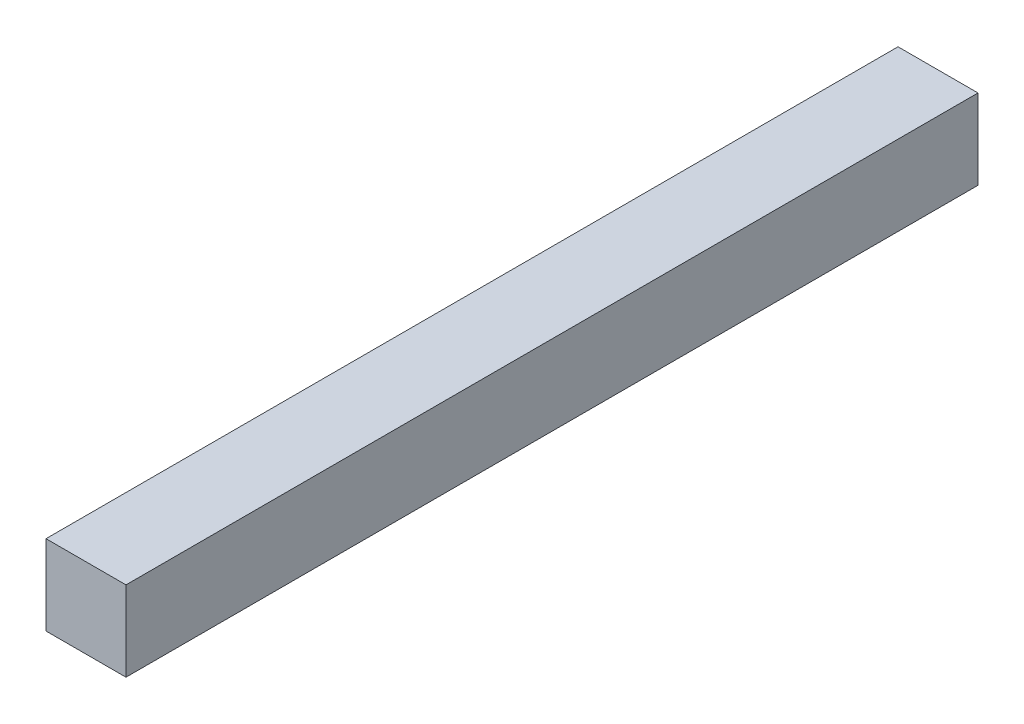
ISO-10303-21;
HEADER;
FILE_DESCRIPTION(('STEP AP214'),'2;1');
FILE_NAME('part.step','',(''),(''),'','','');
FILE_SCHEMA(('AUTOMOTIVE_DESIGN { 1 0 10303 214 1 1 1 1 }'));
ENDSEC;
DATA;
#1=APPLICATION_CONTEXT('core data for automotive mechanical design processes');
#2=APPLICATION_PROTOCOL_DEFINITION('international standard','automotive_design',2000,#1);
#3=PRODUCT_CONTEXT('',#1,'mechanical');
#4=PRODUCT('Part','Part','',(#3));
#5=PRODUCT_RELATED_PRODUCT_CATEGORY('part','',(#4));
#6=PRODUCT_DEFINITION_FORMATION('','',#4);
#7=PRODUCT_DEFINITION_CONTEXT('part definition',#1,'design');
#8=PRODUCT_DEFINITION('design','',#6,#7);
#9=PRODUCT_DEFINITION_SHAPE('','',#8);
#10=(LENGTH_UNIT() NAMED_UNIT(*) SI_UNIT(.MILLI.,.METRE.));
#11=(NAMED_UNIT(*) PLANE_ANGLE_UNIT() SI_UNIT($,.RADIAN.));
#12=(NAMED_UNIT(*) SI_UNIT($,.STERADIAN.) SOLID_ANGLE_UNIT());
#13=UNCERTAINTY_MEASURE_WITH_UNIT(LENGTH_MEASURE(1.E-05),#10,'distance_accuracy_value','');
#14=(GEOMETRIC_REPRESENTATION_CONTEXT(3) GLOBAL_UNCERTAINTY_ASSIGNED_CONTEXT((#13)) GLOBAL_UNIT_ASSIGNED_CONTEXT((#10,
#11,#12)) REPRESENTATION_CONTEXT('',''));
#15=CARTESIAN_POINT('',(0.,0.,0.));
#16=DIRECTION('',(0.,0.,1.));
#17=DIRECTION('',(1.,0.,0.));
#18=AXIS2_PLACEMENT_3D('',#15,#16,#17);
#19=CARTESIAN_POINT('',(0.009999980000003,0.009999980000003,0.));
#20=DIRECTION('',(1.,0.,0.));
#21=DIRECTION('',(0.,0.,-1.));
#22=AXIS2_PLACEMENT_3D('',#19,#20,#21);
#23=PLANE('',#22);
#24=DIRECTION('',(0.,0.,-1.));
#25=VECTOR('',#24,1.);
#26=CARTESIAN_POINT('',(0.009999980000003,0.,0.));
#27=LINE('',#26,#25);
#28=CARTESIAN_POINT('',(0.009999980000003,0.,0.));
#29=VERTEX_POINT('',#28);
#30=CARTESIAN_POINT('',(0.009999980000003,0.,0.10651998));
#31=VERTEX_POINT('',#30);
#32=EDGE_CURVE('E19',#29,#31,#27,.F.);
#33=ORIENTED_EDGE('',*,*,#32,.F.);
#34=DIRECTION('',(0.,1.,0.));
#35=VECTOR('',#34,1.);
#36=CARTESIAN_POINT('',(0.009999980000003,0.,0.));
#37=LINE('',#36,#35);
#38=CARTESIAN_POINT('',(0.009999980000003,0.009999980000003,0.));
#39=VERTEX_POINT('',#38);
#40=EDGE_CURVE('E79',#29,#39,#37,.T.);
#41=ORIENTED_EDGE('',*,*,#40,.T.);
#42=DIRECTION('',(0.,0.,1.));
#43=VECTOR('',#42,1.);
#44=CARTESIAN_POINT('',(0.009999980000003,0.009999980000003,0.));
#45=LINE('',#44,#43);
#46=CARTESIAN_POINT('',(0.009999980000003,0.009999980000003,0.10651998));
#47=VERTEX_POINT('',#46);
#48=EDGE_CURVE('E67',#47,#39,#45,.F.);
#49=ORIENTED_EDGE('',*,*,#48,.F.);
#50=DIRECTION('',(0.,1.,0.));
#51=VECTOR('',#50,1.);
#52=CARTESIAN_POINT('',(0.009999980000003,0.,0.10651998));
#53=LINE('',#52,#51);
#54=EDGE_CURVE('E55',#31,#47,#53,.T.);
#55=ORIENTED_EDGE('',*,*,#54,.F.);
#56=EDGE_LOOP('',(#33,#41,#49,#55));
#57=FACE_BOUND('',#56,.T.);
#58=ADVANCED_FACE('F16',(#57),#23,.T.);
#59=CARTESIAN_POINT('',(0.009999980000003,0.,0.));
#60=DIRECTION('',(0.,-1.,0.));
#61=DIRECTION('',(0.,0.,-1.));
#62=AXIS2_PLACEMENT_3D('',#59,#60,#61);
#63=PLANE('',#62);
#64=DIRECTION('',(0.,0.,1.));
#65=VECTOR('',#64,1.);
#66=CARTESIAN_POINT('',(0.,0.,0.));
#67=LINE('',#66,#65);
#68=CARTESIAN_POINT('',(0.,0.,0.));
#69=VERTEX_POINT('',#68);
#70=CARTESIAN_POINT('',(0.,0.,0.10651998));
#71=VERTEX_POINT('',#70);
#72=EDGE_CURVE('E82',#69,#71,#67,.T.);
#73=ORIENTED_EDGE('',*,*,#72,.F.);
#74=DIRECTION('',(1.,0.,0.));
#75=VECTOR('',#74,1.);
#76=CARTESIAN_POINT('',(0.,0.,0.));
#77=LINE('',#76,#75);
#78=EDGE_CURVE('E64',#69,#29,#77,.T.);
#79=ORIENTED_EDGE('',*,*,#78,.T.);
#80=ORIENTED_EDGE('',*,*,#32,.T.);
#81=DIRECTION('',(1.,0.,0.));
#82=VECTOR('',#81,1.);
#83=CARTESIAN_POINT('',(0.,0.,0.10651998));
#84=LINE('',#83,#82);
#85=EDGE_CURVE('E61',#71,#31,#84,.T.);
#86=ORIENTED_EDGE('',*,*,#85,.F.);
#87=EDGE_LOOP('',(#73,#79,#80,#86));
#88=FACE_BOUND('',#87,.T.);
#89=ADVANCED_FACE('F60',(#88),#63,.T.);
#90=CARTESIAN_POINT('',(0.,0.,0.10651998));
#91=DIRECTION('',(0.,0.,1.));
#92=DIRECTION('',(1.,0.,0.));
#93=AXIS2_PLACEMENT_3D('',#90,#91,#92);
#94=PLANE('',#93);
#95=DIRECTION('',(1.,0.,0.));
#96=VECTOR('',#95,1.);
#97=CARTESIAN_POINT('',(0.,0.009999980000003,0.10651998));
#98=LINE('',#97,#96);
#99=CARTESIAN_POINT('',(0.,0.009999980000003,0.10651998));
#100=VERTEX_POINT('',#99);
#101=EDGE_CURVE('E69',#100,#47,#98,.T.);
#102=ORIENTED_EDGE('',*,*,#101,.F.);
#103=DIRECTION('',(0.,1.,0.));
#104=VECTOR('',#103,1.);
#105=CARTESIAN_POINT('',(0.,0.,0.10651998));
#106=LINE('',#105,#104);
#107=EDGE_CURVE('E73',#71,#100,#106,.T.);
#108=ORIENTED_EDGE('',*,*,#107,.F.);
#109=ORIENTED_EDGE('',*,*,#85,.T.);
#110=ORIENTED_EDGE('',*,*,#54,.T.);
#111=EDGE_LOOP('',(#102,#108,#109,#110));
#112=FACE_BOUND('',#111,.T.);
#113=ADVANCED_FACE('F71',(#112),#94,.T.);
#114=CARTESIAN_POINT('',(0.,0.009999980000003,0.));
#115=DIRECTION('',(0.,1.,0.));
#116=DIRECTION('',(0.,0.,1.));
#117=AXIS2_PLACEMENT_3D('',#114,#115,#116);
#118=PLANE('',#117);
#119=ORIENTED_EDGE('',*,*,#48,.T.);
#120=DIRECTION('',(1.,0.,0.));
#121=VECTOR('',#120,1.);
#122=CARTESIAN_POINT('',(0.,0.009999980000003,0.));
#123=LINE('',#122,#121);
#124=CARTESIAN_POINT('',(0.,0.009999980000003,0.));
#125=VERTEX_POINT('',#124);
#126=EDGE_CURVE('E34',#39,#125,#123,.F.);
#127=ORIENTED_EDGE('',*,*,#126,.T.);
#128=DIRECTION('',(0.,0.,1.));
#129=VECTOR('',#128,1.);
#130=CARTESIAN_POINT('',(0.,0.009999980000003,0.));
#131=LINE('',#130,#129);
#132=EDGE_CURVE('E25',#100,#125,#131,.F.);
#133=ORIENTED_EDGE('',*,*,#132,.F.);
#134=ORIENTED_EDGE('',*,*,#101,.T.);
#135=EDGE_LOOP('',(#119,#127,#133,#134));
#136=FACE_BOUND('',#135,.T.);
#137=ADVANCED_FACE('F88',(#136),#118,.T.);
#138=CARTESIAN_POINT('',(0.,0.,0.));
#139=DIRECTION('',(0.,0.,1.));
#140=DIRECTION('',(1.,0.,0.));
#141=AXIS2_PLACEMENT_3D('',#138,#139,#140);
#142=PLANE('',#141);
#143=ORIENTED_EDGE('',*,*,#126,.F.);
#144=ORIENTED_EDGE('',*,*,#40,.F.);
#145=ORIENTED_EDGE('',*,*,#78,.F.);
#146=DIRECTION('',(0.,1.,0.));
#147=VECTOR('',#146,1.);
#148=CARTESIAN_POINT('',(0.,0.,0.));
#149=LINE('',#148,#147);
#150=EDGE_CURVE('E10',#125,#69,#149,.F.);
#151=ORIENTED_EDGE('',*,*,#150,.F.);
#152=EDGE_LOOP('',(#143,#144,#145,#151));
#153=FACE_BOUND('',#152,.T.);
#154=ADVANCED_FACE('F90',(#153),#142,.F.);
#155=CARTESIAN_POINT('',(0.,0.,0.));
#156=DIRECTION('',(-1.,0.,0.));
#157=DIRECTION('',(0.,0.,1.));
#158=AXIS2_PLACEMENT_3D('',#155,#156,#157);
#159=PLANE('',#158);
#160=ORIENTED_EDGE('',*,*,#132,.T.);
#161=ORIENTED_EDGE('',*,*,#150,.T.);
#162=ORIENTED_EDGE('',*,*,#72,.T.);
#163=ORIENTED_EDGE('',*,*,#107,.T.);
#164=EDGE_LOOP('',(#160,#161,#162,#163));
#165=FACE_BOUND('',#164,.T.);
#166=ADVANCED_FACE('F87',(#165),#159,.T.);
#167=CLOSED_SHELL('',(#58,#89,#113,#137,#154,#166));
#168=MANIFOLD_SOLID_BREP('B1',#167);
#169=ADVANCED_BREP_SHAPE_REPRESENTATION('',(#18,#168),#14);
#170=SHAPE_DEFINITION_REPRESENTATION(#9,#169);
ENDSEC;
END-ISO-10303-21;
